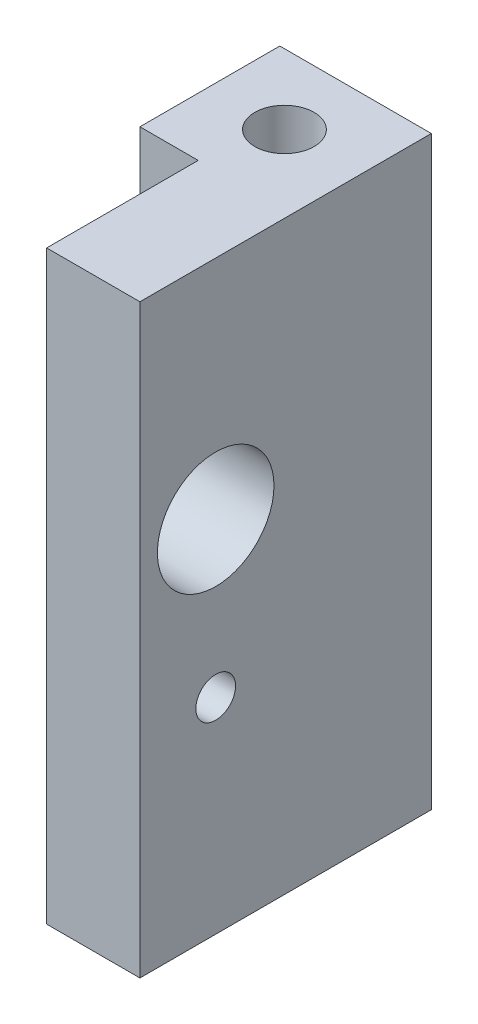
ISO-10303-21;
HEADER;
FILE_DESCRIPTION(('STEP AP214'),'2;1');
FILE_NAME('part.step','',(''),(''),'','','');
FILE_SCHEMA(('AUTOMOTIVE_DESIGN { 1 0 10303 214 1 1 1 1 }'));
ENDSEC;
DATA;
#1=APPLICATION_CONTEXT('core data for automotive mechanical design processes');
#2=APPLICATION_PROTOCOL_DEFINITION('international standard','automotive_design',2000,#1);
#3=PRODUCT_CONTEXT('',#1,'mechanical');
#4=PRODUCT('Part','Part','',(#3));
#5=PRODUCT_RELATED_PRODUCT_CATEGORY('part','',(#4));
#6=PRODUCT_DEFINITION_FORMATION('','',#4);
#7=PRODUCT_DEFINITION_CONTEXT('part definition',#1,'design');
#8=PRODUCT_DEFINITION('design','',#6,#7);
#9=PRODUCT_DEFINITION_SHAPE('','',#8);
#10=(LENGTH_UNIT() NAMED_UNIT(*) SI_UNIT(.MILLI.,.METRE.));
#11=(NAMED_UNIT(*) PLANE_ANGLE_UNIT() SI_UNIT($,.RADIAN.));
#12=(NAMED_UNIT(*) SI_UNIT($,.STERADIAN.) SOLID_ANGLE_UNIT());
#13=UNCERTAINTY_MEASURE_WITH_UNIT(LENGTH_MEASURE(1.E-05),#10,'distance_accuracy_value','');
#14=(GEOMETRIC_REPRESENTATION_CONTEXT(3) GLOBAL_UNCERTAINTY_ASSIGNED_CONTEXT((#13)) GLOBAL_UNIT_ASSIGNED_CONTEXT((#10,
#11,#12)) REPRESENTATION_CONTEXT('',''));
#15=CARTESIAN_POINT('',(0.,0.,0.));
#16=DIRECTION('',(0.,0.,1.));
#17=DIRECTION('',(1.,0.,0.));
#18=AXIS2_PLACEMENT_3D('',#15,#16,#17);
#19=CARTESIAN_POINT('',(0.,39.878,10.31875));
#20=DIRECTION('',(1.,0.,0.));
#21=DIRECTION('',(0.,0.,-1.));
#22=AXIS2_PLACEMENT_3D('',#19,#20,#21);
#23=PLANE('',#22);
#24=CARTESIAN_POINT('',(0.,24.4725400000061,5.159375));
#25=DIRECTION('',(1.,0.,0.));
#26=DIRECTION('',(0.,0.,-1.));
#27=AXIS2_PLACEMENT_3D('',#24,#25,#26);
#28=CIRCLE('',#27,3.96874999999959);
#29=CARTESIAN_POINT('',(0.,24.4725400000061,1.19062500000041));
#30=VERTEX_POINT('',#29);
#31=EDGE_CURVE('E180',#30,#30,#28,.F.);
#32=ORIENTED_EDGE('',*,*,#31,.F.);
#33=EDGE_LOOP('',(#32));
#34=FACE_BOUND('',#33,.T.);
#35=DIRECTION('',(0.,0.,1.));
#36=VECTOR('',#35,1.);
#37=CARTESIAN_POINT('',(0.,0.,10.31875));
#38=LINE('',#37,#36);
#39=CARTESIAN_POINT('',(0.,0.,0.));
#40=VERTEX_POINT('',#39);
#41=CARTESIAN_POINT('',(0.,0.,10.31875));
#42=VERTEX_POINT('',#41);
#43=EDGE_CURVE('E133',#40,#42,#38,.T.);
#44=ORIENTED_EDGE('',*,*,#43,.T.);
#45=DIRECTION('',(0.,-1.,0.));
#46=VECTOR('',#45,1.);
#47=CARTESIAN_POINT('',(0.,39.878,10.31875));
#48=LINE('',#47,#46);
#49=CARTESIAN_POINT('',(0.,39.878,10.31875));
#50=VERTEX_POINT('',#49);
#51=EDGE_CURVE('E11',#50,#42,#48,.T.);
#52=ORIENTED_EDGE('',*,*,#51,.F.);
#53=DIRECTION('',(0.,0.,1.));
#54=VECTOR('',#53,1.);
#55=CARTESIAN_POINT('',(0.,39.878,10.31875));
#56=LINE('',#55,#54);
#57=CARTESIAN_POINT('',(0.,39.878,0.));
#58=VERTEX_POINT('',#57);
#59=EDGE_CURVE('E144',#58,#50,#56,.T.);
#60=ORIENTED_EDGE('',*,*,#59,.F.);
#61=DIRECTION('',(0.,-1.,0.));
#62=VECTOR('',#61,1.);
#63=CARTESIAN_POINT('',(0.,39.878,0.));
#64=LINE('',#63,#62);
#65=EDGE_CURVE('E129',#58,#40,#64,.T.);
#66=ORIENTED_EDGE('',*,*,#65,.T.);
#67=EDGE_LOOP('',(#44,#52,#60,#66));
#68=FACE_BOUND('',#67,.T.);
#69=CARTESIAN_POINT('',(0.,13.97254,5.159375));
#70=DIRECTION('',(-1.,0.,0.));
#71=DIRECTION('',(0.,0.,1.));
#72=AXIS2_PLACEMENT_3D('',#69,#70,#71);
#73=CIRCLE('',#72,1.35255);
#74=CARTESIAN_POINT('',(0.,13.97254,6.511925));
#75=VERTEX_POINT('',#74);
#76=EDGE_CURVE('E182',#75,#75,#73,.T.);
#77=ORIENTED_EDGE('',*,*,#76,.F.);
#78=EDGE_LOOP('',(#77));
#79=FACE_BOUND('',#78,.T.);
#80=ADVANCED_FACE('F49',(#34,#68,#79),#23,.F.);
#81=CARTESIAN_POINT('',(6.35,39.878,10.31875));
#82=DIRECTION('',(0.,0.,-1.));
#83=DIRECTION('',(-1.,0.,0.));
#84=AXIS2_PLACEMENT_3D('',#81,#82,#83);
#85=PLANE('',#84);
#86=DIRECTION('',(1.,0.,0.));
#87=VECTOR('',#86,1.);
#88=CARTESIAN_POINT('',(6.35,0.,10.31875));
#89=LINE('',#88,#87);
#90=CARTESIAN_POINT('',(6.35,0.,10.31875));
#91=VERTEX_POINT('',#90);
#92=EDGE_CURVE('E136',#42,#91,#89,.T.);
#93=ORIENTED_EDGE('',*,*,#92,.T.);
#94=DIRECTION('',(0.,-1.,0.));
#95=VECTOR('',#94,1.);
#96=CARTESIAN_POINT('',(6.35,39.878,10.31875));
#97=LINE('',#96,#95);
#98=CARTESIAN_POINT('',(6.35,39.878,10.31875));
#99=VERTEX_POINT('',#98);
#100=EDGE_CURVE('E57',#99,#91,#97,.T.);
#101=ORIENTED_EDGE('',*,*,#100,.F.);
#102=DIRECTION('',(1.,0.,0.));
#103=VECTOR('',#102,1.);
#104=CARTESIAN_POINT('',(6.35,39.878,10.31875));
#105=LINE('',#104,#103);
#106=EDGE_CURVE('E102',#50,#99,#105,.T.);
#107=ORIENTED_EDGE('',*,*,#106,.F.);
#108=ORIENTED_EDGE('',*,*,#51,.T.);
#109=EDGE_LOOP('',(#93,#101,#107,#108));
#110=FACE_BOUND('',#109,.T.);
#111=ADVANCED_FACE('F171',(#110),#85,.F.);
#112=CARTESIAN_POINT('',(6.35,39.878,-9.525));
#113=DIRECTION('',(-1.,0.,0.));
#114=DIRECTION('',(0.,0.,1.));
#115=AXIS2_PLACEMENT_3D('',#112,#113,#114);
#116=PLANE('',#115);
#117=CARTESIAN_POINT('',(6.35,24.4725400000061,5.159375));
#118=DIRECTION('',(1.,0.,0.));
#119=DIRECTION('',(0.,0.,-1.));
#120=AXIS2_PLACEMENT_3D('',#117,#118,#119);
#121=CIRCLE('',#120,3.96874999999959);
#122=CARTESIAN_POINT('',(6.35,24.4725400000061,1.19062500000041));
#123=VERTEX_POINT('',#122);
#124=EDGE_CURVE('E183',#123,#123,#121,.T.);
#125=ORIENTED_EDGE('',*,*,#124,.F.);
#126=EDGE_LOOP('',(#125));
#127=FACE_BOUND('',#126,.T.);
#128=CARTESIAN_POINT('',(6.35,13.97254,5.159375));
#129=DIRECTION('',(-1.,0.,0.));
#130=DIRECTION('',(0.,0.,1.));
#131=AXIS2_PLACEMENT_3D('',#128,#129,#130);
#132=CIRCLE('',#131,1.35255);
#133=CARTESIAN_POINT('',(6.35,13.97254,6.511925));
#134=VERTEX_POINT('',#133);
#135=EDGE_CURVE('E186',#134,#134,#132,.T.);
#136=ORIENTED_EDGE('',*,*,#135,.T.);
#137=EDGE_LOOP('',(#136));
#138=FACE_BOUND('',#137,.T.);
#139=DIRECTION('',(0.,0.,-1.));
#140=VECTOR('',#139,1.);
#141=CARTESIAN_POINT('',(6.35,0.,-9.525));
#142=LINE('',#141,#140);
#143=CARTESIAN_POINT('',(6.35,0.,-9.525));
#144=VERTEX_POINT('',#143);
#145=EDGE_CURVE('E139',#91,#144,#142,.T.);
#146=ORIENTED_EDGE('',*,*,#145,.T.);
#147=DIRECTION('',(0.,-1.,0.));
#148=VECTOR('',#147,1.);
#149=CARTESIAN_POINT('',(6.35,39.878,-9.525));
#150=LINE('',#149,#148);
#151=CARTESIAN_POINT('',(6.35,39.878,-9.525));
#152=VERTEX_POINT('',#151);
#153=EDGE_CURVE('E124',#152,#144,#150,.T.);
#154=ORIENTED_EDGE('',*,*,#153,.F.);
#155=DIRECTION('',(0.,0.,-1.));
#156=VECTOR('',#155,1.);
#157=CARTESIAN_POINT('',(6.35,39.878,-9.525));
#158=LINE('',#157,#156);
#159=EDGE_CURVE('E115',#99,#152,#158,.T.);
#160=ORIENTED_EDGE('',*,*,#159,.F.);
#161=ORIENTED_EDGE('',*,*,#100,.T.);
#162=EDGE_LOOP('',(#146,#154,#160,#161));
#163=FACE_BOUND('',#162,.T.);
#164=ADVANCED_FACE('F150',(#127,#138,#163),#116,.F.);
#165=CARTESIAN_POINT('',(-3.96875,39.878,-9.525));
#166=DIRECTION('',(0.,0.,1.));
#167=DIRECTION('',(1.,0.,0.));
#168=AXIS2_PLACEMENT_3D('',#165,#166,#167);
#169=PLANE('',#168);
#170=DIRECTION('',(-1.,0.,0.));
#171=VECTOR('',#170,1.);
#172=CARTESIAN_POINT('',(-3.96875,0.,-9.525));
#173=LINE('',#172,#171);
#174=CARTESIAN_POINT('',(-3.96875,0.,-9.525));
#175=VERTEX_POINT('',#174);
#176=EDGE_CURVE('E123',#144,#175,#173,.T.);
#177=ORIENTED_EDGE('',*,*,#176,.T.);
#178=DIRECTION('',(0.,-1.,0.));
#179=VECTOR('',#178,1.);
#180=CARTESIAN_POINT('',(-3.96875,39.878,-9.525));
#181=LINE('',#180,#179);
#182=CARTESIAN_POINT('',(-3.96875,39.878,-9.525));
#183=VERTEX_POINT('',#182);
#184=EDGE_CURVE('E120',#183,#175,#181,.T.);
#185=ORIENTED_EDGE('',*,*,#184,.F.);
#186=DIRECTION('',(-1.,0.,0.));
#187=VECTOR('',#186,1.);
#188=CARTESIAN_POINT('',(-3.96875,39.878,-9.525));
#189=LINE('',#188,#187);
#190=EDGE_CURVE('E109',#152,#183,#189,.T.);
#191=ORIENTED_EDGE('',*,*,#190,.F.);
#192=ORIENTED_EDGE('',*,*,#153,.T.);
#193=EDGE_LOOP('',(#177,#185,#191,#192));
#194=FACE_BOUND('',#193,.T.);
#195=ADVANCED_FACE('F121',(#194),#169,.F.);
#196=CARTESIAN_POINT('',(-3.96875,39.878,0.));
#197=DIRECTION('',(1.,0.,0.));
#198=DIRECTION('',(0.,0.,-1.));
#199=AXIS2_PLACEMENT_3D('',#196,#197,#198);
#200=PLANE('',#199);
#201=DIRECTION('',(0.,0.,1.));
#202=VECTOR('',#201,1.);
#203=CARTESIAN_POINT('',(-3.96875,0.,0.));
#204=LINE('',#203,#202);
#205=CARTESIAN_POINT('',(-3.96875,0.,0.));
#206=VERTEX_POINT('',#205);
#207=EDGE_CURVE('E88',#175,#206,#204,.T.);
#208=ORIENTED_EDGE('',*,*,#207,.T.);
#209=DIRECTION('',(0.,-1.,0.));
#210=VECTOR('',#209,1.);
#211=CARTESIAN_POINT('',(-3.96875,39.878,0.));
#212=LINE('',#211,#210);
#213=CARTESIAN_POINT('',(-3.96875,39.878,0.));
#214=VERTEX_POINT('',#213);
#215=EDGE_CURVE('E125',#214,#206,#212,.T.);
#216=ORIENTED_EDGE('',*,*,#215,.F.);
#217=DIRECTION('',(0.,0.,1.));
#218=VECTOR('',#217,1.);
#219=CARTESIAN_POINT('',(-3.96875,39.878,0.));
#220=LINE('',#219,#218);
#221=EDGE_CURVE('E113',#183,#214,#220,.T.);
#222=ORIENTED_EDGE('',*,*,#221,.F.);
#223=ORIENTED_EDGE('',*,*,#184,.T.);
#224=EDGE_LOOP('',(#208,#216,#222,#223));
#225=FACE_BOUND('',#224,.T.);
#226=ADVANCED_FACE('F127',(#225),#200,.F.);
#227=CARTESIAN_POINT('',(0.,39.878,0.));
#228=DIRECTION('',(0.,0.,-1.));
#229=DIRECTION('',(-1.,0.,0.));
#230=AXIS2_PLACEMENT_3D('',#227,#228,#229);
#231=PLANE('',#230);
#232=DIRECTION('',(1.,0.,0.));
#233=VECTOR('',#232,1.);
#234=CARTESIAN_POINT('',(0.,0.,0.));
#235=LINE('',#234,#233);
#236=EDGE_CURVE('E94',#206,#40,#235,.T.);
#237=ORIENTED_EDGE('',*,*,#236,.T.);
#238=ORIENTED_EDGE('',*,*,#65,.F.);
#239=DIRECTION('',(1.,0.,0.));
#240=VECTOR('',#239,1.);
#241=CARTESIAN_POINT('',(0.,39.878,0.));
#242=LINE('',#241,#240);
#243=EDGE_CURVE('E65',#214,#58,#242,.T.);
#244=ORIENTED_EDGE('',*,*,#243,.F.);
#245=ORIENTED_EDGE('',*,*,#215,.T.);
#246=EDGE_LOOP('',(#237,#238,#244,#245));
#247=FACE_BOUND('',#246,.T.);
#248=ADVANCED_FACE('F158',(#247),#231,.F.);
#249=CARTESIAN_POINT('',(0.,39.878,0.));
#250=DIRECTION('',(0.,1.,0.));
#251=DIRECTION('',(0.,0.,1.));
#252=AXIS2_PLACEMENT_3D('',#249,#250,#251);
#253=PLANE('',#252);
#254=CARTESIAN_POINT('',(1.11125,39.878,-4.7625));
#255=DIRECTION('',(0.,1.,0.));
#256=DIRECTION('',(0.,0.,1.));
#257=AXIS2_PLACEMENT_3D('',#254,#255,#256);
#258=CIRCLE('',#257,2.01929999999999);
#259=CARTESIAN_POINT('',(1.11125,39.878,-2.74320000000001));
#260=VERTEX_POINT('',#259);
#261=EDGE_CURVE('E193',#260,#260,#258,.T.);
#262=ORIENTED_EDGE('',*,*,#261,.F.);
#263=EDGE_LOOP('',(#262));
#264=FACE_BOUND('',#263,.T.);
#265=ORIENTED_EDGE('',*,*,#59,.T.);
#266=ORIENTED_EDGE('',*,*,#106,.T.);
#267=ORIENTED_EDGE('',*,*,#159,.T.);
#268=ORIENTED_EDGE('',*,*,#190,.T.);
#269=ORIENTED_EDGE('',*,*,#221,.T.);
#270=ORIENTED_EDGE('',*,*,#243,.T.);
#271=EDGE_LOOP('',(#265,#266,#267,#268,#269,#270));
#272=FACE_BOUND('',#271,.T.);
#273=ADVANCED_FACE('F111',(#264,#272),#253,.T.);
#274=CARTESIAN_POINT('',(0.,0.,0.));
#275=DIRECTION('',(0.,1.,0.));
#276=DIRECTION('',(0.,0.,1.));
#277=AXIS2_PLACEMENT_3D('',#274,#275,#276);
#278=PLANE('',#277);
#279=CARTESIAN_POINT('',(1.11125,0.,-4.7625));
#280=DIRECTION('',(0.,1.,0.));
#281=DIRECTION('',(0.,0.,1.));
#282=AXIS2_PLACEMENT_3D('',#279,#280,#281);
#283=CIRCLE('',#282,2.01929999999999);
#284=CARTESIAN_POINT('',(1.11125,0.,-2.74320000000001));
#285=VERTEX_POINT('',#284);
#286=EDGE_CURVE('E137',#285,#285,#283,.T.);
#287=ORIENTED_EDGE('',*,*,#286,.T.);
#288=EDGE_LOOP('',(#287));
#289=FACE_BOUND('',#288,.T.);
#290=ORIENTED_EDGE('',*,*,#43,.F.);
#291=ORIENTED_EDGE('',*,*,#236,.F.);
#292=ORIENTED_EDGE('',*,*,#207,.F.);
#293=ORIENTED_EDGE('',*,*,#176,.F.);
#294=ORIENTED_EDGE('',*,*,#145,.F.);
#295=ORIENTED_EDGE('',*,*,#92,.F.);
#296=EDGE_LOOP('',(#290,#291,#292,#293,#294,#295));
#297=FACE_BOUND('',#296,.T.);
#298=ADVANCED_FACE('F153',(#289,#297),#278,.F.);
#299=CARTESIAN_POINT('',(1.11125,39.878,-4.7625));
#300=DIRECTION('',(0.,1.,0.));
#301=DIRECTION('',(0.,0.,1.));
#302=AXIS2_PLACEMENT_3D('',#299,#300,#301);
#303=CYLINDRICAL_SURFACE('',#302,2.01929999999999);
#304=ORIENTED_EDGE('',*,*,#286,.F.);
#305=EDGE_LOOP('',(#304));
#306=FACE_BOUND('',#305,.T.);
#307=ORIENTED_EDGE('',*,*,#261,.T.);
#308=EDGE_LOOP('',(#307));
#309=FACE_BOUND('',#308,.T.);
#310=ADVANCED_FACE('F202',(#306,#309),#303,.F.);
#311=CARTESIAN_POINT('',(0.,13.97254,5.159375));
#312=DIRECTION('',(-1.,0.,0.));
#313=DIRECTION('',(0.,0.,1.));
#314=AXIS2_PLACEMENT_3D('',#311,#312,#313);
#315=CYLINDRICAL_SURFACE('',#314,1.35255);
#316=ORIENTED_EDGE('',*,*,#135,.F.);
#317=EDGE_LOOP('',(#316));
#318=FACE_BOUND('',#317,.T.);
#319=ORIENTED_EDGE('',*,*,#76,.T.);
#320=EDGE_LOOP('',(#319));
#321=FACE_BOUND('',#320,.T.);
#322=ADVANCED_FACE('F205',(#318,#321),#315,.F.);
#323=CARTESIAN_POINT('',(-3.96975,24.4725400000061,5.159375));
#324=DIRECTION('',(1.,0.,0.));
#325=DIRECTION('',(0.,0.,-1.));
#326=AXIS2_PLACEMENT_3D('',#323,#324,#325);
#327=CYLINDRICAL_SURFACE('',#326,3.96874999999959);
#328=ORIENTED_EDGE('',*,*,#124,.T.);
#329=EDGE_LOOP('',(#328));
#330=FACE_BOUND('',#329,.T.);
#331=ORIENTED_EDGE('',*,*,#31,.T.);
#332=EDGE_LOOP('',(#331));
#333=FACE_BOUND('',#332,.T.);
#334=ADVANCED_FACE('F211',(#330,#333),#327,.F.);
#335=CLOSED_SHELL('',(#80,#111,#164,#195,#226,#248,#273,#298,#310,#322,#334));
#336=MANIFOLD_SOLID_BREP('B2',#335);
#337=ADVANCED_BREP_SHAPE_REPRESENTATION('',(#18,#336),#14);
#338=SHAPE_DEFINITION_REPRESENTATION(#9,#337);
ENDSEC;
END-ISO-10303-21;
